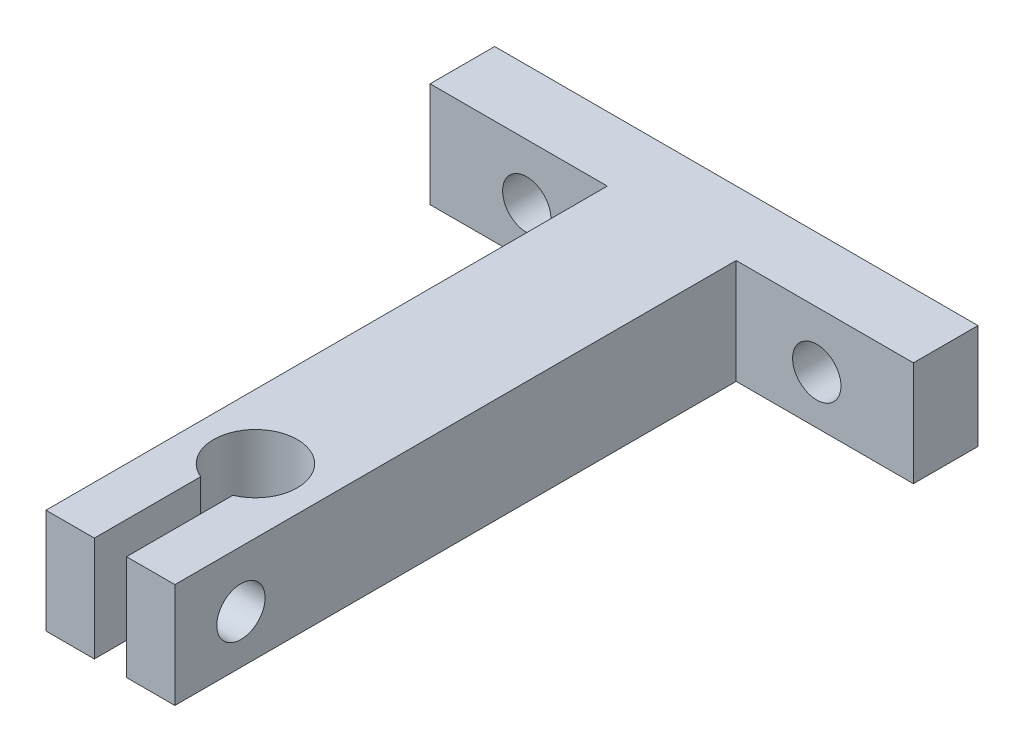
ISO-10303-21;
HEADER;
FILE_DESCRIPTION(('STEP AP214'),'2;1');
FILE_NAME('part.step','',(''),(''),'','','');
FILE_SCHEMA(('AUTOMOTIVE_DESIGN { 1 0 10303 214 1 1 1 1 }'));
ENDSEC;
DATA;
#1=APPLICATION_CONTEXT('core data for automotive mechanical design processes');
#2=APPLICATION_PROTOCOL_DEFINITION('international standard','automotive_design',2000,#1);
#3=PRODUCT_CONTEXT('',#1,'mechanical');
#4=PRODUCT('Part','Part','',(#3));
#5=PRODUCT_RELATED_PRODUCT_CATEGORY('part','',(#4));
#6=PRODUCT_DEFINITION_FORMATION('','',#4);
#7=PRODUCT_DEFINITION_CONTEXT('part definition',#1,'design');
#8=PRODUCT_DEFINITION('design','',#6,#7);
#9=PRODUCT_DEFINITION_SHAPE('','',#8);
#10=(LENGTH_UNIT() NAMED_UNIT(*) SI_UNIT(.MILLI.,.METRE.));
#11=(NAMED_UNIT(*) PLANE_ANGLE_UNIT() SI_UNIT($,.RADIAN.));
#12=(NAMED_UNIT(*) SI_UNIT($,.STERADIAN.) SOLID_ANGLE_UNIT());
#13=UNCERTAINTY_MEASURE_WITH_UNIT(LENGTH_MEASURE(1.E-05),#10,'distance_accuracy_value','');
#14=(GEOMETRIC_REPRESENTATION_CONTEXT(3) GLOBAL_UNCERTAINTY_ASSIGNED_CONTEXT((#13)) GLOBAL_UNIT_ASSIGNED_CONTEXT((#10,
#11,#12)) REPRESENTATION_CONTEXT('',''));
#15=CARTESIAN_POINT('',(0.,0.,0.));
#16=DIRECTION('',(0.,0.,1.));
#17=DIRECTION('',(1.,0.,0.));
#18=AXIS2_PLACEMENT_3D('',#15,#16,#17);
#19=CARTESIAN_POINT('',(0.,7.,27.8457983193277));
#20=DIRECTION('',(0.,-1.,0.));
#21=DIRECTION('',(0.,0.,-1.));
#22=AXIS2_PLACEMENT_3D('',#19,#20,#21);
#23=CYLINDRICAL_SURFACE('',#22,2.6);
#24=DIRECTION('',(0.,-1.,0.));
#25=VECTOR('',#24,1.);
#26=CARTESIAN_POINT('',(-1.,7.,30.2457983193277));
#27=LINE('',#26,#25);
#28=CARTESIAN_POINT('',(-1.,7.,30.2457983193277));
#29=VERTEX_POINT('',#28);
#30=CARTESIAN_POINT('',(-1.,0.499999999999994,30.2457983193277));
#31=VERTEX_POINT('',#30);
#32=EDGE_CURVE('E227',#29,#31,#27,.T.);
#33=ORIENTED_EDGE('',*,*,#32,.T.);
#34=CARTESIAN_POINT('',(0.,0.499999999999994,27.8457983193277));
#35=DIRECTION('',(0.,1.,0.));
#36=DIRECTION('',(0.,0.,1.));
#37=AXIS2_PLACEMENT_3D('',#34,#35,#36);
#38=CIRCLE('',#37,2.6);
#39=CARTESIAN_POINT('',(1.,0.499999999999994,30.2457983193277));
#40=VERTEX_POINT('',#39);
#41=EDGE_CURVE('E11',#31,#40,#38,.F.);
#42=ORIENTED_EDGE('',*,*,#41,.T.);
#43=DIRECTION('',(0.,-1.,0.));
#44=VECTOR('',#43,1.);
#45=CARTESIAN_POINT('',(1.,7.,30.2457983193277));
#46=LINE('',#45,#44);
#47=CARTESIAN_POINT('',(1.,7.,30.2457983193277));
#48=VERTEX_POINT('',#47);
#49=EDGE_CURVE('E169',#48,#40,#46,.T.);
#50=ORIENTED_EDGE('',*,*,#49,.F.);
#51=CARTESIAN_POINT('',(0.,7.,27.8457983193277));
#52=DIRECTION('',(0.,1.,0.));
#53=DIRECTION('',(0.,0.,1.));
#54=AXIS2_PLACEMENT_3D('',#51,#52,#53);
#55=CIRCLE('',#54,2.6);
#56=EDGE_CURVE('E171',#48,#29,#55,.T.);
#57=ORIENTED_EDGE('',*,*,#56,.T.);
#58=EDGE_LOOP('',(#33,#42,#50,#57));
#59=FACE_BOUND('',#58,.T.);
#60=ADVANCED_FACE('F41',(#59),#23,.F.);
#61=CARTESIAN_POINT('',(1.,7.,0.));
#62=DIRECTION('',(-1.,0.,0.));
#63=DIRECTION('',(0.,0.,1.));
#64=AXIS2_PLACEMENT_3D('',#61,#62,#63);
#65=PLANE('',#64);
#66=CARTESIAN_POINT('',(1.,3.5,32.7457983193277));
#67=DIRECTION('',(-1.,0.,0.));
#68=DIRECTION('',(0.,0.,1.));
#69=AXIS2_PLACEMENT_3D('',#66,#67,#68);
#70=CIRCLE('',#69,1.5);
#71=CARTESIAN_POINT('',(1.,3.5,34.2457983193277));
#72=VERTEX_POINT('',#71);
#73=EDGE_CURVE('E191',#72,#72,#70,.T.);
#74=ORIENTED_EDGE('',*,*,#73,.F.);
#75=EDGE_LOOP('',(#74));
#76=FACE_BOUND('',#75,.T.);
#77=ORIENTED_EDGE('',*,*,#49,.T.);
#78=DIRECTION('',(0.,0.,1.));
#79=VECTOR('',#78,1.);
#80=CARTESIAN_POINT('',(1.,0.499999999999994,36.8457983193277));
#81=LINE('',#80,#79);
#82=CARTESIAN_POINT('',(1.,0.499999999999994,36.8457983193277));
#83=VERTEX_POINT('',#82);
#84=EDGE_CURVE('E313',#40,#83,#81,.T.);
#85=ORIENTED_EDGE('',*,*,#84,.T.);
#86=DIRECTION('',(0.,-1.,0.));
#87=VECTOR('',#86,1.);
#88=CARTESIAN_POINT('',(1.,7.,36.8457983193277));
#89=LINE('',#88,#87);
#90=CARTESIAN_POINT('',(1.,7.,36.8457983193277));
#91=VERTEX_POINT('',#90);
#92=EDGE_CURVE('E179',#91,#83,#89,.T.);
#93=ORIENTED_EDGE('',*,*,#92,.F.);
#94=DIRECTION('',(0.,0.,-1.));
#95=VECTOR('',#94,1.);
#96=CARTESIAN_POINT('',(1.,7.,0.));
#97=LINE('',#96,#95);
#98=EDGE_CURVE('E185',#91,#48,#97,.T.);
#99=ORIENTED_EDGE('',*,*,#98,.T.);
#100=EDGE_LOOP('',(#77,#85,#93,#99));
#101=FACE_BOUND('',#100,.T.);
#102=ADVANCED_FACE('F193',(#76,#101),#65,.T.);
#103=CARTESIAN_POINT('',(0.,7.,36.8457983193277));
#104=DIRECTION('',(0.,0.,1.));
#105=DIRECTION('',(1.,0.,0.));
#106=AXIS2_PLACEMENT_3D('',#103,#104,#105);
#107=PLANE('',#106);
#108=ORIENTED_EDGE('',*,*,#92,.T.);
#109=DIRECTION('',(1.,0.,0.));
#110=VECTOR('',#109,1.);
#111=CARTESIAN_POINT('',(4.,0.499999999999994,36.8457983193277));
#112=LINE('',#111,#110);
#113=CARTESIAN_POINT('',(4.,0.499999999999994,36.8457983193277));
#114=VERTEX_POINT('',#113);
#115=EDGE_CURVE('E316',#83,#114,#112,.T.);
#116=ORIENTED_EDGE('',*,*,#115,.T.);
#117=DIRECTION('',(0.,-1.,0.));
#118=VECTOR('',#117,1.);
#119=CARTESIAN_POINT('',(4.,7.,36.8457983193277));
#120=LINE('',#119,#118);
#121=CARTESIAN_POINT('',(4.,7.,36.8457983193277));
#122=VERTEX_POINT('',#121);
#123=EDGE_CURVE('E260',#122,#114,#120,.T.);
#124=ORIENTED_EDGE('',*,*,#123,.F.);
#125=DIRECTION('',(-1.,0.,0.));
#126=VECTOR('',#125,1.);
#127=CARTESIAN_POINT('',(0.,7.,36.8457983193277));
#128=LINE('',#127,#126);
#129=EDGE_CURVE('E196',#122,#91,#128,.T.);
#130=ORIENTED_EDGE('',*,*,#129,.T.);
#131=EDGE_LOOP('',(#108,#116,#124,#130));
#132=FACE_BOUND('',#131,.T.);
#133=ADVANCED_FACE('F446',(#132),#107,.T.);
#134=CARTESIAN_POINT('',(4.,7.,0.));
#135=DIRECTION('',(1.,0.,0.));
#136=DIRECTION('',(0.,0.,-1.));
#137=AXIS2_PLACEMENT_3D('',#134,#135,#136);
#138=PLANE('',#137);
#139=CARTESIAN_POINT('',(4.,3.5,32.7457983193277));
#140=DIRECTION('',(1.,0.,0.));
#141=DIRECTION('',(0.,0.,-1.));
#142=AXIS2_PLACEMENT_3D('',#139,#140,#141);
#143=CIRCLE('',#142,1.5);
#144=CARTESIAN_POINT('',(4.,3.5,31.2457983193277));
#145=VERTEX_POINT('',#144);
#146=EDGE_CURVE('E271',#145,#145,#143,.T.);
#147=ORIENTED_EDGE('',*,*,#146,.F.);
#148=EDGE_LOOP('',(#147));
#149=FACE_BOUND('',#148,.T.);
#150=ORIENTED_EDGE('',*,*,#123,.T.);
#151=DIRECTION('',(0.,0.,-1.));
#152=VECTOR('',#151,1.);
#153=CARTESIAN_POINT('',(4.,0.499999999999994,2.00420168067227));
#154=LINE('',#153,#152);
#155=CARTESIAN_POINT('',(4.,0.499999999999994,2.00420168067227));
#156=VERTEX_POINT('',#155);
#157=EDGE_CURVE('E319',#114,#156,#154,.T.);
#158=ORIENTED_EDGE('',*,*,#157,.T.);
#159=DIRECTION('',(0.,-1.,0.));
#160=VECTOR('',#159,1.);
#161=CARTESIAN_POINT('',(4.,7.,2.00420168067227));
#162=LINE('',#161,#160);
#163=CARTESIAN_POINT('',(4.,7.,2.00420168067227));
#164=VERTEX_POINT('',#163);
#165=EDGE_CURVE('E256',#164,#156,#162,.T.);
#166=ORIENTED_EDGE('',*,*,#165,.F.);
#167=DIRECTION('',(0.,0.,1.));
#168=VECTOR('',#167,1.);
#169=CARTESIAN_POINT('',(4.,7.,0.));
#170=LINE('',#169,#168);
#171=EDGE_CURVE('E199',#164,#122,#170,.T.);
#172=ORIENTED_EDGE('',*,*,#171,.T.);
#173=EDGE_LOOP('',(#150,#158,#166,#172));
#174=FACE_BOUND('',#173,.T.);
#175=ADVANCED_FACE('F452',(#149,#174),#138,.T.);
#176=CARTESIAN_POINT('',(0.,7.,2.00420168067227));
#177=DIRECTION('',(0.,0.,-1.));
#178=DIRECTION('',(-1.,0.,0.));
#179=AXIS2_PLACEMENT_3D('',#176,#177,#178);
#180=PLANE('',#179);
#181=CARTESIAN_POINT('',(9.,3.5,2.00420168067227));
#182=DIRECTION('',(0.,0.,1.));
#183=DIRECTION('',(1.,0.,0.));
#184=AXIS2_PLACEMENT_3D('',#181,#182,#183);
#185=CIRCLE('',#184,1.5);
#186=CARTESIAN_POINT('',(10.5,3.5,2.00420168067227));
#187=VERTEX_POINT('',#186);
#188=EDGE_CURVE('E422',#187,#187,#185,.T.);
#189=ORIENTED_EDGE('',*,*,#188,.F.);
#190=EDGE_LOOP('',(#189));
#191=FACE_BOUND('',#190,.T.);
#192=ORIENTED_EDGE('',*,*,#165,.T.);
#193=DIRECTION('',(1.,0.,0.));
#194=VECTOR('',#193,1.);
#195=CARTESIAN_POINT('',(0.,0.499999999999994,2.00420168067227));
#196=LINE('',#195,#194);
#197=CARTESIAN_POINT('',(15.,0.499999999999994,2.00420168067227));
#198=VERTEX_POINT('',#197);
#199=EDGE_CURVE('E322',#156,#198,#196,.T.);
#200=ORIENTED_EDGE('',*,*,#199,.T.);
#201=DIRECTION('',(0.,-1.,0.));
#202=VECTOR('',#201,1.);
#203=CARTESIAN_POINT('',(15.,7.,2.00420168067227));
#204=LINE('',#203,#202);
#205=CARTESIAN_POINT('',(15.,7.,2.00420168067227));
#206=VERTEX_POINT('',#205);
#207=EDGE_CURVE('E252',#206,#198,#204,.T.);
#208=ORIENTED_EDGE('',*,*,#207,.F.);
#209=DIRECTION('',(1.,0.,0.));
#210=VECTOR('',#209,1.);
#211=CARTESIAN_POINT('',(0.,7.,2.00420168067227));
#212=LINE('',#211,#210);
#213=EDGE_CURVE('E207',#164,#206,#212,.T.);
#214=ORIENTED_EDGE('',*,*,#213,.F.);
#215=EDGE_LOOP('',(#192,#200,#208,#214));
#216=FACE_BOUND('',#215,.T.);
#217=ADVANCED_FACE('F459',(#191,#216),#180,.F.);
#218=CARTESIAN_POINT('',(15.,7.,0.));
#219=DIRECTION('',(1.,0.,0.));
#220=DIRECTION('',(0.,0.,-1.));
#221=AXIS2_PLACEMENT_3D('',#218,#219,#220);
#222=PLANE('',#221);
#223=ORIENTED_EDGE('',*,*,#207,.T.);
#224=DIRECTION('',(0.,0.,-1.));
#225=VECTOR('',#224,1.);
#226=CARTESIAN_POINT('',(15.,0.499999999999994,-2.00420168067227));
#227=LINE('',#226,#225);
#228=CARTESIAN_POINT('',(15.,0.499999999999994,-2.00420168067227));
#229=VERTEX_POINT('',#228);
#230=EDGE_CURVE('E325',#198,#229,#227,.T.);
#231=ORIENTED_EDGE('',*,*,#230,.T.);
#232=DIRECTION('',(0.,-1.,0.));
#233=VECTOR('',#232,1.);
#234=CARTESIAN_POINT('',(15.,7.,-2.00420168067227));
#235=LINE('',#234,#233);
#236=CARTESIAN_POINT('',(15.,7.,-2.00420168067227));
#237=VERTEX_POINT('',#236);
#238=EDGE_CURVE('E248',#237,#229,#235,.T.);
#239=ORIENTED_EDGE('',*,*,#238,.F.);
#240=DIRECTION('',(0.,0.,1.));
#241=VECTOR('',#240,1.);
#242=CARTESIAN_POINT('',(15.,7.,0.));
#243=LINE('',#242,#241);
#244=EDGE_CURVE('E210',#237,#206,#243,.T.);
#245=ORIENTED_EDGE('',*,*,#244,.T.);
#246=EDGE_LOOP('',(#223,#231,#239,#245));
#247=FACE_BOUND('',#246,.T.);
#248=ADVANCED_FACE('F461',(#247),#222,.T.);
#249=CARTESIAN_POINT('',(0.,7.,-2.00420168067227));
#250=DIRECTION('',(0.,0.,-1.));
#251=DIRECTION('',(-1.,0.,0.));
#252=AXIS2_PLACEMENT_3D('',#249,#250,#251);
#253=PLANE('',#252);
#254=CARTESIAN_POINT('',(9.,3.5,-2.00420168067227));
#255=DIRECTION('',(0.,0.,-1.));
#256=DIRECTION('',(-1.,0.,0.));
#257=AXIS2_PLACEMENT_3D('',#254,#255,#256);
#258=CIRCLE('',#257,1.5);
#259=CARTESIAN_POINT('',(7.5,3.5,-2.00420168067227));
#260=VERTEX_POINT('',#259);
#261=EDGE_CURVE('E272',#260,#260,#258,.T.);
#262=ORIENTED_EDGE('',*,*,#261,.F.);
#263=EDGE_LOOP('',(#262));
#264=FACE_BOUND('',#263,.T.);
#265=CARTESIAN_POINT('',(-9.,3.5,-2.00420168067227));
#266=DIRECTION('',(0.,0.,-1.));
#267=DIRECTION('',(-1.,0.,0.));
#268=AXIS2_PLACEMENT_3D('',#265,#266,#267);
#269=CIRCLE('',#268,1.5);
#270=CARTESIAN_POINT('',(-10.5,3.5,-2.00420168067227));
#271=VERTEX_POINT('',#270);
#272=EDGE_CURVE('E276',#271,#271,#269,.T.);
#273=ORIENTED_EDGE('',*,*,#272,.F.);
#274=EDGE_LOOP('',(#273));
#275=FACE_BOUND('',#274,.T.);
#276=ORIENTED_EDGE('',*,*,#238,.T.);
#277=DIRECTION('',(-1.,0.,0.));
#278=VECTOR('',#277,1.);
#279=CARTESIAN_POINT('',(-15.,0.499999999999994,-2.00420168067227));
#280=LINE('',#279,#278);
#281=CARTESIAN_POINT('',(-15.,0.499999999999994,-2.00420168067227));
#282=VERTEX_POINT('',#281);
#283=EDGE_CURVE('E328',#229,#282,#280,.T.);
#284=ORIENTED_EDGE('',*,*,#283,.T.);
#285=DIRECTION('',(0.,-1.,0.));
#286=VECTOR('',#285,1.);
#287=CARTESIAN_POINT('',(-15.,7.,-2.00420168067227));
#288=LINE('',#287,#286);
#289=CARTESIAN_POINT('',(-15.,7.,-2.00420168067227));
#290=VERTEX_POINT('',#289);
#291=EDGE_CURVE('E244',#290,#282,#288,.T.);
#292=ORIENTED_EDGE('',*,*,#291,.F.);
#293=DIRECTION('',(1.,0.,0.));
#294=VECTOR('',#293,1.);
#295=CARTESIAN_POINT('',(0.,7.,-2.00420168067227));
#296=LINE('',#295,#294);
#297=EDGE_CURVE('E215',#290,#237,#296,.T.);
#298=ORIENTED_EDGE('',*,*,#297,.T.);
#299=EDGE_LOOP('',(#276,#284,#292,#298));
#300=FACE_BOUND('',#299,.T.);
#301=ADVANCED_FACE('F464',(#264,#275,#300),#253,.T.);
#302=CARTESIAN_POINT('',(-15.,7.,0.));
#303=DIRECTION('',(1.,0.,0.));
#304=DIRECTION('',(0.,0.,-1.));
#305=AXIS2_PLACEMENT_3D('',#302,#303,#304);
#306=PLANE('',#305);
#307=ORIENTED_EDGE('',*,*,#291,.T.);
#308=DIRECTION('',(0.,0.,1.));
#309=VECTOR('',#308,1.);
#310=CARTESIAN_POINT('',(-15.,0.499999999999994,0.));
#311=LINE('',#310,#309);
#312=CARTESIAN_POINT('',(-15.,0.499999999999994,2.00420168067227));
#313=VERTEX_POINT('',#312);
#314=EDGE_CURVE('E331',#282,#313,#311,.T.);
#315=ORIENTED_EDGE('',*,*,#314,.T.);
#316=DIRECTION('',(0.,-1.,0.));
#317=VECTOR('',#316,1.);
#318=CARTESIAN_POINT('',(-15.,7.,2.00420168067227));
#319=LINE('',#318,#317);
#320=CARTESIAN_POINT('',(-15.,7.,2.00420168067227));
#321=VERTEX_POINT('',#320);
#322=EDGE_CURVE('E240',#321,#313,#319,.T.);
#323=ORIENTED_EDGE('',*,*,#322,.F.);
#324=DIRECTION('',(0.,0.,1.));
#325=VECTOR('',#324,1.);
#326=CARTESIAN_POINT('',(-15.,7.,0.));
#327=LINE('',#326,#325);
#328=EDGE_CURVE('E219',#290,#321,#327,.T.);
#329=ORIENTED_EDGE('',*,*,#328,.F.);
#330=EDGE_LOOP('',(#307,#315,#323,#329));
#331=FACE_BOUND('',#330,.T.);
#332=ADVANCED_FACE('F468',(#331),#306,.F.);
#333=CARTESIAN_POINT('',(-9.,3.5,2.00420168067227));
#334=DIRECTION('',(0.,0.,1.));
#335=DIRECTION('',(-1.,0.,0.));
#336=AXIS2_PLACEMENT_3D('',#333,#334,#335);
#337=CIRCLE('',#336,1.5);
#338=CARTESIAN_POINT('',(-10.5,3.5,2.00420168067227));
#339=VERTEX_POINT('',#338);
#340=EDGE_CURVE('E415',#339,#339,#337,.T.);
#341=ORIENTED_EDGE('',*,*,#340,.F.);
#342=EDGE_LOOP('',(#341));
#343=FACE_BOUND('',#342,.T.);
#344=ORIENTED_EDGE('',*,*,#322,.T.);
#345=DIRECTION('',(1.,0.,0.));
#346=VECTOR('',#345,1.);
#347=CARTESIAN_POINT('',(0.,0.499999999999994,2.00420168067227));
#348=LINE('',#347,#346);
#349=CARTESIAN_POINT('',(-4.,0.499999999999994,2.00420168067227));
#350=VERTEX_POINT('',#349);
#351=EDGE_CURVE('E334',#313,#350,#348,.T.);
#352=ORIENTED_EDGE('',*,*,#351,.T.);
#353=DIRECTION('',(0.,-1.,0.));
#354=VECTOR('',#353,1.);
#355=CARTESIAN_POINT('',(-4.,7.,2.00420168067227));
#356=LINE('',#355,#354);
#357=CARTESIAN_POINT('',(-4.,7.,2.00420168067227));
#358=VERTEX_POINT('',#357);
#359=EDGE_CURVE('E236',#358,#350,#356,.T.);
#360=ORIENTED_EDGE('',*,*,#359,.F.);
#361=EDGE_CURVE('E211',#321,#358,#212,.T.);
#362=ORIENTED_EDGE('',*,*,#361,.F.);
#363=EDGE_LOOP('',(#344,#352,#360,#362));
#364=FACE_BOUND('',#363,.T.);
#365=ADVANCED_FACE('F472',(#343,#364),#180,.F.);
#366=CARTESIAN_POINT('',(-4.,7.,0.));
#367=DIRECTION('',(1.,0.,0.));
#368=DIRECTION('',(0.,0.,-1.));
#369=AXIS2_PLACEMENT_3D('',#366,#367,#368);
#370=PLANE('',#369);
#371=CARTESIAN_POINT('',(-4.,3.5,32.7457983193277));
#372=DIRECTION('',(1.,0.,0.));
#373=DIRECTION('',(0.,0.,-1.));
#374=AXIS2_PLACEMENT_3D('',#371,#372,#373);
#375=CIRCLE('',#374,1.5);
#376=CARTESIAN_POINT('',(-4.,3.5,31.2457983193277));
#377=VERTEX_POINT('',#376);
#378=EDGE_CURVE('E270',#377,#377,#375,.T.);
#379=ORIENTED_EDGE('',*,*,#378,.T.);
#380=EDGE_LOOP('',(#379));
#381=FACE_BOUND('',#380,.T.);
#382=ORIENTED_EDGE('',*,*,#359,.T.);
#383=DIRECTION('',(0.,0.,1.));
#384=VECTOR('',#383,1.);
#385=CARTESIAN_POINT('',(-4.,0.499999999999994,0.));
#386=LINE('',#385,#384);
#387=CARTESIAN_POINT('',(-4.,0.499999999999994,36.8457983193277));
#388=VERTEX_POINT('',#387);
#389=EDGE_CURVE('E337',#350,#388,#386,.T.);
#390=ORIENTED_EDGE('',*,*,#389,.T.);
#391=DIRECTION('',(0.,-1.,0.));
#392=VECTOR('',#391,1.);
#393=CARTESIAN_POINT('',(-4.,7.,36.8457983193277));
#394=LINE('',#393,#392);
#395=CARTESIAN_POINT('',(-4.,7.,36.8457983193277));
#396=VERTEX_POINT('',#395);
#397=EDGE_CURVE('E233',#396,#388,#394,.T.);
#398=ORIENTED_EDGE('',*,*,#397,.F.);
#399=DIRECTION('',(0.,0.,1.));
#400=VECTOR('',#399,1.);
#401=CARTESIAN_POINT('',(-4.,7.,0.));
#402=LINE('',#401,#400);
#403=EDGE_CURVE('E222',#358,#396,#402,.T.);
#404=ORIENTED_EDGE('',*,*,#403,.F.);
#405=EDGE_LOOP('',(#382,#390,#398,#404));
#406=FACE_BOUND('',#405,.T.);
#407=ADVANCED_FACE('F476',(#381,#406),#370,.F.);
#408=ORIENTED_EDGE('',*,*,#397,.T.);
#409=DIRECTION('',(1.,0.,0.));
#410=VECTOR('',#409,1.);
#411=CARTESIAN_POINT('',(-1.,0.499999999999994,36.8457983193277));
#412=LINE('',#411,#410);
#413=CARTESIAN_POINT('',(-1.,0.499999999999994,36.8457983193277));
#414=VERTEX_POINT('',#413);
#415=EDGE_CURVE('E66',#388,#414,#412,.T.);
#416=ORIENTED_EDGE('',*,*,#415,.T.);
#417=DIRECTION('',(0.,-1.,0.));
#418=VECTOR('',#417,1.);
#419=CARTESIAN_POINT('',(-1.,7.,36.8457983193277));
#420=LINE('',#419,#418);
#421=CARTESIAN_POINT('',(-1.,7.,36.8457983193277));
#422=VERTEX_POINT('',#421);
#423=EDGE_CURVE('E230',#422,#414,#420,.T.);
#424=ORIENTED_EDGE('',*,*,#423,.F.);
#425=EDGE_CURVE('E201',#422,#396,#128,.T.);
#426=ORIENTED_EDGE('',*,*,#425,.T.);
#427=EDGE_LOOP('',(#408,#416,#424,#426));
#428=FACE_BOUND('',#427,.T.);
#429=ADVANCED_FACE('F455',(#428),#107,.T.);
#430=CARTESIAN_POINT('',(-1.,7.,0.));
#431=DIRECTION('',(-1.,0.,0.));
#432=DIRECTION('',(0.,0.,1.));
#433=AXIS2_PLACEMENT_3D('',#430,#431,#432);
#434=PLANE('',#433);
#435=CARTESIAN_POINT('',(-0.999999999999999,3.5,32.7457983193277));
#436=DIRECTION('',(-1.,0.,0.));
#437=DIRECTION('',(0.,0.,1.));
#438=AXIS2_PLACEMENT_3D('',#435,#436,#437);
#439=CIRCLE('',#438,1.5);
#440=CARTESIAN_POINT('',(-0.999999999999999,3.5,34.2457983193277));
#441=VERTEX_POINT('',#440);
#442=EDGE_CURVE('E266',#441,#441,#439,.T.);
#443=ORIENTED_EDGE('',*,*,#442,.T.);
#444=EDGE_LOOP('',(#443));
#445=FACE_BOUND('',#444,.T.);
#446=ORIENTED_EDGE('',*,*,#423,.T.);
#447=DIRECTION('',(0.,0.,-1.));
#448=VECTOR('',#447,1.);
#449=CARTESIAN_POINT('',(-1.,0.499999999999994,0.));
#450=LINE('',#449,#448);
#451=EDGE_CURVE('E51',#414,#31,#450,.T.);
#452=ORIENTED_EDGE('',*,*,#451,.T.);
#453=ORIENTED_EDGE('',*,*,#32,.F.);
#454=DIRECTION('',(0.,0.,-1.));
#455=VECTOR('',#454,1.);
#456=CARTESIAN_POINT('',(-1.,7.,0.));
#457=LINE('',#456,#455);
#458=EDGE_CURVE('E189',#422,#29,#457,.T.);
#459=ORIENTED_EDGE('',*,*,#458,.F.);
#460=EDGE_LOOP('',(#446,#452,#453,#459));
#461=FACE_BOUND('',#460,.T.);
#462=ADVANCED_FACE('F482',(#445,#461),#434,.F.);
#463=CARTESIAN_POINT('',(0.,7.,0.));
#464=DIRECTION('',(0.,1.,0.));
#465=DIRECTION('',(0.,0.,1.));
#466=AXIS2_PLACEMENT_3D('',#463,#464,#465);
#467=PLANE('',#466);
#468=ORIENTED_EDGE('',*,*,#56,.F.);
#469=ORIENTED_EDGE('',*,*,#98,.F.);
#470=ORIENTED_EDGE('',*,*,#129,.F.);
#471=ORIENTED_EDGE('',*,*,#171,.F.);
#472=ORIENTED_EDGE('',*,*,#213,.T.);
#473=ORIENTED_EDGE('',*,*,#244,.F.);
#474=ORIENTED_EDGE('',*,*,#297,.F.);
#475=ORIENTED_EDGE('',*,*,#328,.T.);
#476=ORIENTED_EDGE('',*,*,#361,.T.);
#477=ORIENTED_EDGE('',*,*,#403,.T.);
#478=ORIENTED_EDGE('',*,*,#425,.F.);
#479=ORIENTED_EDGE('',*,*,#458,.T.);
#480=EDGE_LOOP('',(#468,#469,#470,#471,#472,#473,#474,#475,#476,#477,#478,#479));
#481=FACE_BOUND('',#480,.T.);
#482=ADVANCED_FACE('F183',(#481),#467,.T.);
#483=CARTESIAN_POINT('',(0.,0.,0.));
#484=DIRECTION('',(0.,1.,0.));
#485=DIRECTION('',(0.,0.,1.));
#486=AXIS2_PLACEMENT_3D('',#483,#484,#485);
#487=PLANE('',#486);
#488=DIRECTION('',(-1.,0.,0.));
#489=VECTOR('',#488,1.);
#490=CARTESIAN_POINT('',(1.,0.,36.2499215230306));
#491=LINE('',#490,#489);
#492=CARTESIAN_POINT('',(3.40412320370291,0.,36.2499215230306));
#493=VERTEX_POINT('',#492);
#494=CARTESIAN_POINT('',(1.59587679629709,0.,36.2499215230306));
#495=VERTEX_POINT('',#494);
#496=EDGE_CURVE('E306',#493,#495,#491,.T.);
#497=ORIENTED_EDGE('',*,*,#496,.T.);
#498=DIRECTION('',(0.,0.,-1.));
#499=VECTOR('',#498,1.);
#500=CARTESIAN_POINT('',(1.59587679629709,0.,30.2457983193277));
#501=LINE('',#500,#499);
#502=CARTESIAN_POINT('',(1.59587679629709,0.,30.6146980553512));
#503=VERTEX_POINT('',#502);
#504=EDGE_CURVE('E309',#495,#503,#501,.T.);
#505=ORIENTED_EDGE('',*,*,#504,.T.);
#506=CARTESIAN_POINT('',(0.,0.,27.8457983193277));
#507=DIRECTION('',(0.,1.,0.));
#508=DIRECTION('',(0.,0.,1.));
#509=AXIS2_PLACEMENT_3D('',#506,#507,#508);
#510=CIRCLE('',#509,3.19587679629709);
#511=CARTESIAN_POINT('',(-1.59587679629709,0.,30.6146980553512));
#512=VERTEX_POINT('',#511);
#513=EDGE_CURVE('E178',#503,#512,#510,.T.);
#514=ORIENTED_EDGE('',*,*,#513,.T.);
#515=DIRECTION('',(0.,0.,1.));
#516=VECTOR('',#515,1.);
#517=CARTESIAN_POINT('',(-1.59587679629709,0.,0.));
#518=LINE('',#517,#516);
#519=CARTESIAN_POINT('',(-1.59587679629709,0.,36.2499215230306));
#520=VERTEX_POINT('',#519);
#521=EDGE_CURVE('E279',#512,#520,#518,.T.);
#522=ORIENTED_EDGE('',*,*,#521,.T.);
#523=DIRECTION('',(-1.,0.,0.));
#524=VECTOR('',#523,1.);
#525=CARTESIAN_POINT('',(-4.,0.,36.2499215230306));
#526=LINE('',#525,#524);
#527=CARTESIAN_POINT('',(-3.40412320370291,0.,36.2499215230306));
#528=VERTEX_POINT('',#527);
#529=EDGE_CURVE('E282',#520,#528,#526,.T.);
#530=ORIENTED_EDGE('',*,*,#529,.T.);
#531=DIRECTION('',(0.,0.,-1.));
#532=VECTOR('',#531,1.);
#533=CARTESIAN_POINT('',(-3.40412320370291,0.,0.));
#534=LINE('',#533,#532);
#535=CARTESIAN_POINT('',(-3.40412320370291,0.,1.40832488437519));
#536=VERTEX_POINT('',#535);
#537=EDGE_CURVE('E285',#528,#536,#534,.T.);
#538=ORIENTED_EDGE('',*,*,#537,.T.);
#539=DIRECTION('',(-1.,0.,0.));
#540=VECTOR('',#539,1.);
#541=CARTESIAN_POINT('',(0.,0.,1.40832488437519));
#542=LINE('',#541,#540);
#543=CARTESIAN_POINT('',(-14.4041232037029,0.,1.40832488437519));
#544=VERTEX_POINT('',#543);
#545=EDGE_CURVE('E288',#536,#544,#542,.T.);
#546=ORIENTED_EDGE('',*,*,#545,.T.);
#547=DIRECTION('',(0.,0.,-1.));
#548=VECTOR('',#547,1.);
#549=CARTESIAN_POINT('',(-14.4041232037029,0.,0.));
#550=LINE('',#549,#548);
#551=CARTESIAN_POINT('',(-14.4041232037029,0.,-1.40832488437519));
#552=VERTEX_POINT('',#551);
#553=EDGE_CURVE('E291',#544,#552,#550,.T.);
#554=ORIENTED_EDGE('',*,*,#553,.T.);
#555=DIRECTION('',(1.,0.,0.));
#556=VECTOR('',#555,1.);
#557=CARTESIAN_POINT('',(15.,0.,-1.40832488437519));
#558=LINE('',#557,#556);
#559=CARTESIAN_POINT('',(14.4041232037029,0.,-1.40832488437519));
#560=VERTEX_POINT('',#559);
#561=EDGE_CURVE('E294',#552,#560,#558,.T.);
#562=ORIENTED_EDGE('',*,*,#561,.T.);
#563=DIRECTION('',(0.,0.,1.));
#564=VECTOR('',#563,1.);
#565=CARTESIAN_POINT('',(14.4041232037029,0.,2.00420168067227));
#566=LINE('',#565,#564);
#567=CARTESIAN_POINT('',(14.4041232037029,0.,1.40832488437519));
#568=VERTEX_POINT('',#567);
#569=EDGE_CURVE('E297',#560,#568,#566,.T.);
#570=ORIENTED_EDGE('',*,*,#569,.T.);
#571=DIRECTION('',(-1.,0.,0.));
#572=VECTOR('',#571,1.);
#573=CARTESIAN_POINT('',(0.,0.,1.40832488437519));
#574=LINE('',#573,#572);
#575=CARTESIAN_POINT('',(3.40412320370291,0.,1.40832488437519));
#576=VERTEX_POINT('',#575);
#577=EDGE_CURVE('E300',#568,#576,#574,.T.);
#578=ORIENTED_EDGE('',*,*,#577,.T.);
#579=DIRECTION('',(0.,0.,1.));
#580=VECTOR('',#579,1.);
#581=CARTESIAN_POINT('',(3.40412320370291,0.,36.8457983193277));
#582=LINE('',#581,#580);
#583=EDGE_CURVE('E303',#576,#493,#582,.T.);
#584=ORIENTED_EDGE('',*,*,#583,.T.);
#585=EDGE_LOOP('',(#497,#505,#514,#522,#530,#538,#546,#554,#562,#570,#578,#584));
#586=FACE_BOUND('',#585,.T.);
#587=ADVANCED_FACE('F486',(#586),#487,.F.);
#588=CARTESIAN_POINT('',(-15.,3.5,32.7457983193277));
#589=DIRECTION('',(1.,0.,0.));
#590=DIRECTION('',(0.,0.,-1.));
#591=AXIS2_PLACEMENT_3D('',#588,#589,#590);
#592=CYLINDRICAL_SURFACE('',#591,1.5);
#593=ORIENTED_EDGE('',*,*,#442,.F.);
#594=EDGE_LOOP('',(#593));
#595=FACE_BOUND('',#594,.T.);
#596=ORIENTED_EDGE('',*,*,#378,.F.);
#597=EDGE_LOOP('',(#596));
#598=FACE_BOUND('',#597,.T.);
#599=ADVANCED_FACE('F489',(#595,#598),#592,.F.);
#600=ORIENTED_EDGE('',*,*,#73,.T.);
#601=EDGE_LOOP('',(#600));
#602=FACE_BOUND('',#601,.T.);
#603=ORIENTED_EDGE('',*,*,#146,.T.);
#604=EDGE_LOOP('',(#603));
#605=FACE_BOUND('',#604,.T.);
#606=ADVANCED_FACE('F442',(#602,#605),#592,.F.);
#607=CARTESIAN_POINT('',(-9.,3.5,-2.99579831932773));
#608=DIRECTION('',(0.,0.,1.));
#609=DIRECTION('',(1.,0.,0.));
#610=AXIS2_PLACEMENT_3D('',#607,#608,#609);
#611=CYLINDRICAL_SURFACE('',#610,1.5);
#612=ORIENTED_EDGE('',*,*,#272,.T.);
#613=EDGE_LOOP('',(#612));
#614=FACE_BOUND('',#613,.T.);
#615=ORIENTED_EDGE('',*,*,#340,.T.);
#616=EDGE_LOOP('',(#615));
#617=FACE_BOUND('',#616,.T.);
#618=ADVANCED_FACE('F495',(#614,#617),#611,.F.);
#619=CARTESIAN_POINT('',(9.,3.5,-2.99579831932773));
#620=DIRECTION('',(0.,0.,1.));
#621=DIRECTION('',(1.,0.,0.));
#622=AXIS2_PLACEMENT_3D('',#619,#620,#621);
#623=CYLINDRICAL_SURFACE('',#622,1.5);
#624=ORIENTED_EDGE('',*,*,#261,.T.);
#625=EDGE_LOOP('',(#624));
#626=FACE_BOUND('',#625,.T.);
#627=ORIENTED_EDGE('',*,*,#188,.T.);
#628=EDGE_LOOP('',(#627));
#629=FACE_BOUND('',#628,.T.);
#630=ADVANCED_FACE('F498',(#626,#629),#623,.F.);
#631=CARTESIAN_POINT('',(-15.,0.499999999999994,0.));
#632=DIRECTION('',(0.642787609686545,0.766044443118973,0.));
#633=DIRECTION('',(0.,0.,1.));
#634=AXIS2_PLACEMENT_3D('',#631,#632,#633);
#635=PLANE('',#634);
#636=DIRECTION('',(0.608120402411341,-0.510273605374742,-0.60812040241134));
#637=VECTOR('',#636,1.);
#638=CARTESIAN_POINT('',(-9.45284364256603,-4.15461685360562,-3.54295467676169));
#639=LINE('',#638,#637);
#640=EDGE_CURVE('E406',#313,#544,#639,.T.);
#641=ORIENTED_EDGE('',*,*,#640,.F.);
#642=ORIENTED_EDGE('',*,*,#314,.F.);
#643=DIRECTION('',(-0.60812040241134,0.510273605374743,-0.608120402411341));
#644=VECTOR('',#643,1.);
#645=CARTESIAN_POINT('',(-14.2588253270319,-0.121919394725461,-1.26302700770421));
#646=LINE('',#645,#644);
#647=EDGE_CURVE('E45',#552,#282,#646,.T.);
#648=ORIENTED_EDGE('',*,*,#647,.F.);
#649=ORIENTED_EDGE('',*,*,#553,.F.);
#650=EDGE_LOOP('',(#641,#642,#648,#649));
#651=FACE_BOUND('',#650,.T.);
#652=ADVANCED_FACE('F43',(#651),#635,.F.);
#653=CARTESIAN_POINT('',(0.,0.,-1.40832488437519));
#654=DIRECTION('',(0.,-0.766044443118973,-0.642787609686545));
#655=DIRECTION('',(-1.,0.,0.));
#656=AXIS2_PLACEMENT_3D('',#653,#654,#655);
#657=PLANE('',#656);
#658=ORIENTED_EDGE('',*,*,#647,.T.);
#659=ORIENTED_EDGE('',*,*,#283,.F.);
#660=DIRECTION('',(-0.608120402411341,-0.510273605374743,0.608120402411341));
#661=VECTOR('',#660,1.);
#662=CARTESIAN_POINT('',(9.0773282968574,-4.46971164169115,3.91847002247032));
#663=LINE('',#662,#661);
#664=EDGE_CURVE('E403',#560,#229,#663,.F.);
#665=ORIENTED_EDGE('',*,*,#664,.F.);
#666=ORIENTED_EDGE('',*,*,#561,.F.);
#667=EDGE_LOOP('',(#658,#659,#665,#666));
#668=FACE_BOUND('',#667,.T.);
#669=ADVANCED_FACE('F505',(#668),#657,.T.);
#670=CARTESIAN_POINT('',(0.,0.499999999999994,2.00420168067227));
#671=DIRECTION('',(0.,0.766044443118973,-0.642787609686545));
#672=DIRECTION('',(1.,0.,0.));
#673=AXIS2_PLACEMENT_3D('',#670,#671,#672);
#674=PLANE('',#673);
#675=ORIENTED_EDGE('',*,*,#640,.T.);
#676=ORIENTED_EDGE('',*,*,#545,.F.);
#677=DIRECTION('',(0.608120402411341,-0.510273605374743,-0.608120402411341));
#678=VECTOR('',#677,1.);
#679=CARTESIAN_POINT('',(-2.52075830468428,-0.741231160961502,0.524959985356551));
#680=LINE('',#679,#678);
#681=EDGE_CURVE('E399',#350,#536,#680,.T.);
#682=ORIENTED_EDGE('',*,*,#681,.F.);
#683=ORIENTED_EDGE('',*,*,#351,.F.);
#684=EDGE_LOOP('',(#675,#676,#682,#683));
#685=FACE_BOUND('',#684,.T.);
#686=ADVANCED_FACE('F538',(#685),#674,.F.);
#687=CARTESIAN_POINT('',(14.4041232037029,0.,0.));
#688=DIRECTION('',(0.642787609686545,-0.766044443118973,0.));
#689=DIRECTION('',(0.,0.,-1.));
#690=AXIS2_PLACEMENT_3D('',#687,#688,#689);
#691=PLANE('',#690);
#692=ORIENTED_EDGE('',*,*,#664,.T.);
#693=ORIENTED_EDGE('',*,*,#230,.F.);
#694=DIRECTION('',(0.608120402411341,0.510273605374743,0.608120402411341));
#695=VECTOR('',#694,1.);
#696=CARTESIAN_POINT('',(13.8833099813233,-0.437014182810994,0.887511661995568));
#697=LINE('',#696,#695);
#698=EDGE_CURVE('E395',#568,#198,#697,.T.);
#699=ORIENTED_EDGE('',*,*,#698,.F.);
#700=ORIENTED_EDGE('',*,*,#569,.F.);
#701=EDGE_LOOP('',(#692,#693,#699,#700));
#702=FACE_BOUND('',#701,.T.);
#703=ADVANCED_FACE('F533',(#702),#691,.T.);
#704=CARTESIAN_POINT('',(-4.,0.499999999999994,0.));
#705=DIRECTION('',(0.642787609686545,0.766044443118973,0.));
#706=DIRECTION('',(0.,0.,1.));
#707=AXIS2_PLACEMENT_3D('',#704,#705,#706);
#708=PLANE('',#707);
#709=ORIENTED_EDGE('',*,*,#681,.T.);
#710=ORIENTED_EDGE('',*,*,#537,.F.);
#711=DIRECTION('',(-0.608120402411342,0.510273605374744,0.608120402411338));
#712=VECTOR('',#711,1.);
#713=CARTESIAN_POINT('',(-2.14524295897563,-1.05632594904704,34.9910412783034));
#714=LINE('',#713,#712);
#715=EDGE_CURVE('E391',#388,#528,#714,.F.);
#716=ORIENTED_EDGE('',*,*,#715,.F.);
#717=ORIENTED_EDGE('',*,*,#389,.F.);
#718=EDGE_LOOP('',(#709,#710,#716,#717));
#719=FACE_BOUND('',#718,.T.);
#720=ADVANCED_FACE('F546',(#719),#708,.F.);
#721=CARTESIAN_POINT('',(0.,0.499999999999994,2.00420168067227));
#722=DIRECTION('',(0.,0.766044443118973,-0.642787609686545));
#723=DIRECTION('',(1.,0.,0.));
#724=AXIS2_PLACEMENT_3D('',#721,#722,#723);
#725=PLANE('',#724);
#726=ORIENTED_EDGE('',*,*,#698,.T.);
#727=ORIENTED_EDGE('',*,*,#199,.F.);
#728=DIRECTION('',(0.608120402411341,0.510273605374743,0.608120402411341));
#729=VECTOR('',#728,1.);
#730=CARTESIAN_POINT('',(2.8833099813233,-0.437014182810994,0.887511661995568));
#731=LINE('',#730,#729);
#732=EDGE_CURVE('E387',#576,#156,#731,.T.);
#733=ORIENTED_EDGE('',*,*,#732,.F.);
#734=ORIENTED_EDGE('',*,*,#577,.F.);
#735=EDGE_LOOP('',(#726,#727,#733,#734));
#736=FACE_BOUND('',#735,.T.);
#737=ADVANCED_FACE('F520',(#736),#725,.F.);
#738=CARTESIAN_POINT('',(0.,0.,36.2499215230306));
#739=DIRECTION('',(0.,-0.766044443118971,0.642787609686547));
#740=DIRECTION('',(1.,0.,0.));
#741=AXIS2_PLACEMENT_3D('',#738,#739,#740);
#742=PLANE('',#741);
#743=ORIENTED_EDGE('',*,*,#715,.T.);
#744=ORIENTED_EDGE('',*,*,#529,.F.);
#745=DIRECTION('',(0.608120402411342,0.510273605374744,0.608120402411338));
#746=VECTOR('',#745,1.);
#747=CARTESIAN_POINT('',(-14.6259602927859,-10.9335382561131,23.2198380265419));
#748=LINE('',#747,#746);
#749=EDGE_CURVE('E383',#414,#520,#748,.F.);
#750=ORIENTED_EDGE('',*,*,#749,.F.);
#751=ORIENTED_EDGE('',*,*,#415,.F.);
#752=EDGE_LOOP('',(#743,#744,#750,#751));
#753=FACE_BOUND('',#752,.T.);
#754=ADVANCED_FACE('F552',(#753),#742,.T.);
#755=CARTESIAN_POINT('',(3.40412320370291,0.,0.));
#756=DIRECTION('',(0.642787609686545,-0.766044443118973,0.));
#757=DIRECTION('',(0.,0.,-1.));
#758=AXIS2_PLACEMENT_3D('',#755,#756,#757);
#759=PLANE('',#758);
#760=ORIENTED_EDGE('',*,*,#732,.T.);
#761=ORIENTED_EDGE('',*,*,#157,.F.);
#762=DIRECTION('',(-0.608120402411342,-0.510273605374744,-0.608120402411338));
#763=VECTOR('',#762,1.);
#764=CARTESIAN_POINT('',(-10.0014756384945,-11.2486330441986,22.8443226808333));
#765=LINE('',#764,#763);
#766=EDGE_CURVE('E379',#493,#114,#765,.F.);
#767=ORIENTED_EDGE('',*,*,#766,.F.);
#768=ORIENTED_EDGE('',*,*,#583,.F.);
#769=EDGE_LOOP('',(#760,#761,#767,#768));
#770=FACE_BOUND('',#769,.T.);
#771=ADVANCED_FACE('F368',(#770),#759,.T.);
#772=CARTESIAN_POINT('',(-1.,0.499999999999994,0.));
#773=DIRECTION('',(-0.642787609686545,0.766044443118973,0.));
#774=DIRECTION('',(0.,0.,-1.));
#775=AXIS2_PLACEMENT_3D('',#772,#773,#774);
#776=PLANE('',#775);
#777=ORIENTED_EDGE('',*,*,#749,.T.);
#778=ORIENTED_EDGE('',*,*,#521,.F.);
#779=CARTESIAN_POINT('',(-1.,0.499999999999994,30.2457983193277));
#780=CARTESIAN_POINT('',(-1.04895795773036,0.458919395725256,30.2784341997886));
#781=CARTESIAN_POINT('',(-1.09811967741354,0.417667814871062,30.3105457418958));
#782=CARTESIAN_POINT('',(-1.19679855243468,0.334866407235827,30.3737932998292));
#783=CARTESIAN_POINT('',(-1.24631563816441,0.293316638863038,30.4049295006206));
#784=CARTESIAN_POINT('',(-1.34566950916943,0.20994884234669,30.466310460021));
#785=CARTESIAN_POINT('',(-1.39550627912474,0.168130827058122,30.496555260965));
#786=CARTESIAN_POINT('',(-1.49547827645739,0.0842443609682365,30.5562260589533));
#787=CARTESIAN_POINT('',(-1.54561355894227,0.0421758639262043,30.5856518987397));
#788=CARTESIAN_POINT('',(-1.59587679629709,0.,30.6146980553512));
#789=B_SPLINE_CURVE_WITH_KNOTS('',3,(#779,#780,#781,#782,#783,#784,#785,#786,#787,#788),
.UNSPECIFIED.,.F.,.F.,(4,2,2,2,4),(0.,0.215277435676174,0.430513795608038,0.645739916864449,
0.861007084897152),.UNSPECIFIED.);
#790=EDGE_CURVE('E371',#31,#512,#789,.T.);
#791=ORIENTED_EDGE('',*,*,#790,.F.);
#792=ORIENTED_EDGE('',*,*,#451,.F.);
#793=EDGE_LOOP('',(#777,#778,#791,#792));
#794=FACE_BOUND('',#793,.T.);
#795=ADVANCED_FACE('F363',(#794),#776,.F.);
#796=CARTESIAN_POINT('',(0.,0.,36.2499215230306));
#797=DIRECTION('',(0.,-0.766044443118971,0.642787609686547));
#798=DIRECTION('',(1.,0.,0.));
#799=AXIS2_PLACEMENT_3D('',#796,#797,#798);
#800=PLANE('',#799);
#801=ORIENTED_EDGE('',*,*,#766,.T.);
#802=ORIENTED_EDGE('',*,*,#115,.F.);
#803=DIRECTION('',(0.608120402411342,-0.510273605374744,-0.608120402411338));
#804=VECTOR('',#803,1.);
#805=CARTESIAN_POINT('',(1.0057049218797,0.495213002154839,36.840093397448));
#806=LINE('',#805,#804);
#807=EDGE_CURVE('E353',#495,#83,#806,.F.);
#808=ORIENTED_EDGE('',*,*,#807,.F.);
#809=ORIENTED_EDGE('',*,*,#496,.F.);
#810=EDGE_LOOP('',(#801,#802,#808,#809));
#811=FACE_BOUND('',#810,.T.);
#812=ADVANCED_FACE('F367',(#811),#800,.T.);
#813=CARTESIAN_POINT('',(0.,0.,27.8457983193277));
#814=DIRECTION('',(0.,-1.,0.));
#815=DIRECTION('',(0.,0.,-1.));
#816=AXIS2_PLACEMENT_3D('',#813,#814,#815);
#817=CONICAL_SURFACE('',#816,3.19587679629709,0.872664625997158);
#818=ORIENTED_EDGE('',*,*,#790,.T.);
#819=ORIENTED_EDGE('',*,*,#513,.F.);
#820=CARTESIAN_POINT('',(1.59587679629709,0.,30.6146980553512));
#821=CARTESIAN_POINT('',(1.54561355894227,0.042175863926204,30.5856518987397));
#822=CARTESIAN_POINT('',(1.49547827645739,0.0842443609682361,30.5562260589533));
#823=CARTESIAN_POINT('',(1.39550627912474,0.168130827058122,30.496555260965));
#824=CARTESIAN_POINT('',(1.34566950916943,0.20994884234669,30.466310460021));
#825=CARTESIAN_POINT('',(1.24631563816441,0.293316638863039,30.4049295006206));
#826=CARTESIAN_POINT('',(1.19679855243468,0.334866407235828,30.3737932998292));
#827=CARTESIAN_POINT('',(1.09811967741354,0.417667814871062,30.3105457418958));
#828=CARTESIAN_POINT('',(1.04895795773036,0.458919395725256,30.2784341997886));
#829=CARTESIAN_POINT('',(1.,0.499999999999995,30.2457983193277));
#830=B_SPLINE_CURVE_WITH_KNOTS('',3,(#820,#821,#822,#823,#824,#825,#826,#827,#828,#829),
.UNSPECIFIED.,.F.,.F.,(4,2,2,2,4),(0.,0.215267168032701,0.430493289289114,0.645729649220979,
0.861007084897151),.UNSPECIFIED.);
#831=EDGE_CURVE('E344',#40,#503,#830,.F.);
#832=ORIENTED_EDGE('',*,*,#831,.F.);
#833=ORIENTED_EDGE('',*,*,#41,.F.);
#834=EDGE_LOOP('',(#818,#819,#832,#833));
#835=FACE_BOUND('',#834,.T.);
#836=ADVANCED_FACE('F355',(#835),#817,.F.);
#837=CARTESIAN_POINT('',(1.59587679629709,0.,0.));
#838=DIRECTION('',(-0.642787609686545,-0.766044443118973,0.));
#839=DIRECTION('',(0.,0.,1.));
#840=AXIS2_PLACEMENT_3D('',#837,#838,#839);
#841=PLANE('',#840);
#842=ORIENTED_EDGE('',*,*,#807,.T.);
#843=ORIENTED_EDGE('',*,*,#84,.F.);
#844=ORIENTED_EDGE('',*,*,#831,.T.);
#845=ORIENTED_EDGE('',*,*,#504,.F.);
#846=EDGE_LOOP('',(#842,#843,#844,#845));
#847=FACE_BOUND('',#846,.T.);
#848=ADVANCED_FACE('F358',(#847),#841,.T.);
#849=CLOSED_SHELL('',(#60,#102,#133,#175,#217,#248,#301,#332,#365,#407,#429,#462,#482,#587,#599,
#606,#618,#630,#652,#669,#686,#703,#720,#737,#754,#771,#795,#812,#836,#848));
#850=MANIFOLD_SOLID_BREP('B2',#849);
#851=ADVANCED_BREP_SHAPE_REPRESENTATION('',(#18,#850),#14);
#852=SHAPE_DEFINITION_REPRESENTATION(#9,#851);
ENDSEC;
END-ISO-10303-21;
